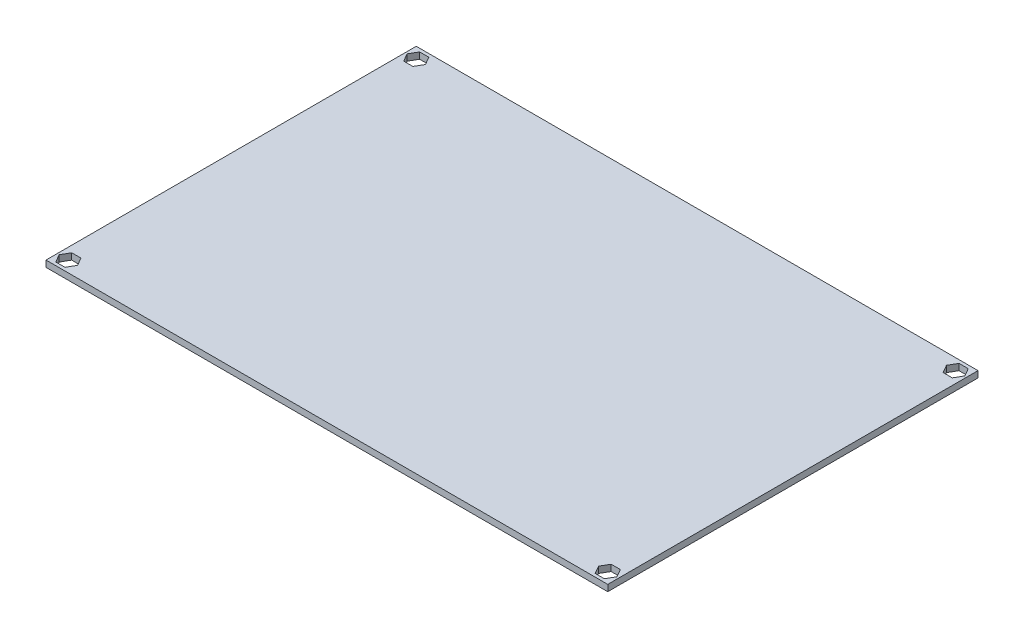
ISO-10303-21;
HEADER;
FILE_DESCRIPTION(('STEP AP214'),'2;1');
FILE_NAME('part.step','',(''),(''),'','','');
FILE_SCHEMA(('AUTOMOTIVE_DESIGN { 1 0 10303 214 1 1 1 1 }'));
ENDSEC;
DATA;
#1=APPLICATION_CONTEXT('core data for automotive mechanical design processes');
#2=APPLICATION_PROTOCOL_DEFINITION('international standard','automotive_design',2000,#1);
#3=PRODUCT_CONTEXT('',#1,'mechanical');
#4=PRODUCT('Part','Part','',(#3));
#5=PRODUCT_RELATED_PRODUCT_CATEGORY('part','',(#4));
#6=PRODUCT_DEFINITION_FORMATION('','',#4);
#7=PRODUCT_DEFINITION_CONTEXT('part definition',#1,'design');
#8=PRODUCT_DEFINITION('design','',#6,#7);
#9=PRODUCT_DEFINITION_SHAPE('','',#8);
#10=(LENGTH_UNIT() NAMED_UNIT(*) SI_UNIT(.MILLI.,.METRE.));
#11=(NAMED_UNIT(*) PLANE_ANGLE_UNIT() SI_UNIT($,.RADIAN.));
#12=(NAMED_UNIT(*) SI_UNIT($,.STERADIAN.) SOLID_ANGLE_UNIT());
#13=UNCERTAINTY_MEASURE_WITH_UNIT(LENGTH_MEASURE(1.E-05),#10,'distance_accuracy_value','');
#14=(GEOMETRIC_REPRESENTATION_CONTEXT(3) GLOBAL_UNCERTAINTY_ASSIGNED_CONTEXT((#13)) GLOBAL_UNIT_ASSIGNED_CONTEXT((#10,
#11,#12)) REPRESENTATION_CONTEXT('',''));
#15=CARTESIAN_POINT('',(0.,0.,0.));
#16=DIRECTION('',(0.,0.,1.));
#17=DIRECTION('',(1.,0.,0.));
#18=AXIS2_PLACEMENT_3D('',#15,#16,#17);
#19=CARTESIAN_POINT('',(-80.21928665786,2.,-70.1439894319683));
#20=DIRECTION('',(1.,0.,0.));
#21=DIRECTION('',(0.,0.,-1.));
#22=AXIS2_PLACEMENT_3D('',#19,#20,#21);
#23=PLANE('',#22);
#24=DIRECTION('',(0.,0.,1.));
#25=VECTOR('',#24,1.);
#26=CARTESIAN_POINT('',(-80.21928665786,0.,-70.1439894319683));
#27=LINE('',#26,#25);
#28=CARTESIAN_POINT('',(-80.21928665786,0.,-70.1439894319683));
#29=VERTEX_POINT('',#28);
#30=CARTESIAN_POINT('',(-80.21928665786,0.,45.8560105680317));
#31=VERTEX_POINT('',#30);
#32=EDGE_CURVE('E410',#29,#31,#27,.T.);
#33=ORIENTED_EDGE('',*,*,#32,.T.);
#34=DIRECTION('',(0.,-1.,0.));
#35=VECTOR('',#34,1.);
#36=CARTESIAN_POINT('',(-80.21928665786,2.,45.8560105680317));
#37=LINE('',#36,#35);
#38=CARTESIAN_POINT('',(-80.21928665786,2.,45.8560105680317));
#39=VERTEX_POINT('',#38);
#40=EDGE_CURVE('E11',#39,#31,#37,.T.);
#41=ORIENTED_EDGE('',*,*,#40,.F.);
#42=DIRECTION('',(0.,0.,1.));
#43=VECTOR('',#42,1.);
#44=CARTESIAN_POINT('',(-80.21928665786,2.,-70.1439894319683));
#45=LINE('',#44,#43);
#46=CARTESIAN_POINT('',(-80.21928665786,2.,-70.1439894319683));
#47=VERTEX_POINT('',#46);
#48=EDGE_CURVE('E421',#47,#39,#45,.T.);
#49=ORIENTED_EDGE('',*,*,#48,.F.);
#50=DIRECTION('',(0.,-1.,0.));
#51=VECTOR('',#50,1.);
#52=CARTESIAN_POINT('',(-80.21928665786,2.,-70.1439894319683));
#53=LINE('',#52,#51);
#54=EDGE_CURVE('E431',#47,#29,#53,.T.);
#55=ORIENTED_EDGE('',*,*,#54,.T.);
#56=EDGE_LOOP('',(#33,#41,#49,#55));
#57=FACE_BOUND('',#56,.T.);
#58=ADVANCED_FACE('F37',(#57),#23,.F.);
#59=CARTESIAN_POINT('',(-80.21928665786,2.,45.8560105680317));
#60=DIRECTION('',(0.,0.,-1.));
#61=DIRECTION('',(-1.,0.,0.));
#62=AXIS2_PLACEMENT_3D('',#59,#60,#61);
#63=PLANE('',#62);
#64=DIRECTION('',(1.,0.,0.));
#65=VECTOR('',#64,1.);
#66=CARTESIAN_POINT('',(-80.21928665786,0.,45.8560105680317));
#67=LINE('',#66,#65);
#68=CARTESIAN_POINT('',(95.7807133421401,0.,45.8560105680317));
#69=VERTEX_POINT('',#68);
#70=EDGE_CURVE('E434',#31,#69,#67,.T.);
#71=ORIENTED_EDGE('',*,*,#70,.T.);
#72=DIRECTION('',(0.,-1.,0.));
#73=VECTOR('',#72,1.);
#74=CARTESIAN_POINT('',(95.7807133421401,2.,45.8560105680317));
#75=LINE('',#74,#73);
#76=CARTESIAN_POINT('',(95.7807133421401,2.,45.8560105680317));
#77=VERTEX_POINT('',#76);
#78=EDGE_CURVE('E44',#77,#69,#75,.T.);
#79=ORIENTED_EDGE('',*,*,#78,.F.);
#80=DIRECTION('',(1.,0.,0.));
#81=VECTOR('',#80,1.);
#82=CARTESIAN_POINT('',(-80.21928665786,2.,45.8560105680317));
#83=LINE('',#82,#81);
#84=EDGE_CURVE('E424',#39,#77,#83,.T.);
#85=ORIENTED_EDGE('',*,*,#84,.F.);
#86=ORIENTED_EDGE('',*,*,#40,.T.);
#87=EDGE_LOOP('',(#71,#79,#85,#86));
#88=FACE_BOUND('',#87,.T.);
#89=ADVANCED_FACE('F463',(#88),#63,.F.);
#90=CARTESIAN_POINT('',(95.78071334214,2.,-70.1439894319683));
#91=DIRECTION('',(-1.,0.,0.));
#92=DIRECTION('',(0.,0.,1.));
#93=AXIS2_PLACEMENT_3D('',#90,#91,#92);
#94=PLANE('',#93);
#95=DIRECTION('',(0.,0.,-1.));
#96=VECTOR('',#95,1.);
#97=CARTESIAN_POINT('',(95.78071334214,0.,-70.1439894319683));
#98=LINE('',#97,#96);
#99=CARTESIAN_POINT('',(95.78071334214,0.,-70.1439894319683));
#100=VERTEX_POINT('',#99);
#101=EDGE_CURVE('E436',#69,#100,#98,.T.);
#102=ORIENTED_EDGE('',*,*,#101,.T.);
#103=DIRECTION('',(0.,-1.,0.));
#104=VECTOR('',#103,1.);
#105=CARTESIAN_POINT('',(95.78071334214,2.,-70.1439894319683));
#106=LINE('',#105,#104);
#107=CARTESIAN_POINT('',(95.78071334214,2.,-70.1439894319683));
#108=VERTEX_POINT('',#107);
#109=EDGE_CURVE('E441',#108,#100,#106,.T.);
#110=ORIENTED_EDGE('',*,*,#109,.F.);
#111=DIRECTION('',(0.,0.,-1.));
#112=VECTOR('',#111,1.);
#113=CARTESIAN_POINT('',(95.78071334214,2.,-70.1439894319683));
#114=LINE('',#113,#112);
#115=EDGE_CURVE('E427',#77,#108,#114,.T.);
#116=ORIENTED_EDGE('',*,*,#115,.F.);
#117=ORIENTED_EDGE('',*,*,#78,.T.);
#118=EDGE_LOOP('',(#102,#110,#116,#117));
#119=FACE_BOUND('',#118,.T.);
#120=ADVANCED_FACE('F448',(#119),#94,.F.);
#121=CARTESIAN_POINT('',(-80.21928665786,2.,-70.1439894319683));
#122=DIRECTION('',(0.,0.,1.));
#123=DIRECTION('',(1.,0.,0.));
#124=AXIS2_PLACEMENT_3D('',#121,#122,#123);
#125=PLANE('',#124);
#126=DIRECTION('',(-1.,0.,0.));
#127=VECTOR('',#126,1.);
#128=CARTESIAN_POINT('',(-80.21928665786,0.,-70.1439894319683));
#129=LINE('',#128,#127);
#130=EDGE_CURVE('E425',#100,#29,#129,.T.);
#131=ORIENTED_EDGE('',*,*,#130,.T.);
#132=ORIENTED_EDGE('',*,*,#54,.F.);
#133=DIRECTION('',(-1.,0.,0.));
#134=VECTOR('',#133,1.);
#135=CARTESIAN_POINT('',(-80.21928665786,2.,-70.1439894319683));
#136=LINE('',#135,#134);
#137=EDGE_CURVE('E429',#108,#47,#136,.T.);
#138=ORIENTED_EDGE('',*,*,#137,.F.);
#139=ORIENTED_EDGE('',*,*,#109,.T.);
#140=EDGE_LOOP('',(#131,#132,#138,#139));
#141=FACE_BOUND('',#140,.T.);
#142=ADVANCED_FACE('F456',(#141),#125,.F.);
#143=CARTESIAN_POINT('',(0.,2.,0.));
#144=DIRECTION('',(0.,1.,0.));
#145=DIRECTION('',(0.,0.,1.));
#146=AXIS2_PLACEMENT_3D('',#143,#144,#145);
#147=PLANE('',#146);
#148=DIRECTION('',(-0.499999999999999,0.,0.866025403784439));
#149=VECTOR('',#148,1.);
#150=CARTESIAN_POINT('',(-79.6060380038081,2.,42.3560105680318));
#151=LINE('',#150,#149);
#152=CARTESIAN_POINT('',(-78.162662330834,2.,39.8560105680318));
#153=VERTEX_POINT('',#152);
#154=CARTESIAN_POINT('',(-79.606038003808,2.,42.3560105680318));
#155=VERTEX_POINT('',#154);
#156=EDGE_CURVE('E51',#153,#155,#151,.T.);
#157=ORIENTED_EDGE('',*,*,#156,.F.);
#158=DIRECTION('',(-1.,0.,0.));
#159=VECTOR('',#158,1.);
#160=CARTESIAN_POINT('',(-78.162662330834,2.,39.8560105680318));
#161=LINE('',#160,#159);
#162=CARTESIAN_POINT('',(-75.2759109848859,2.,39.8560105680318));
#163=VERTEX_POINT('',#162);
#164=EDGE_CURVE('E332',#163,#153,#161,.T.);
#165=ORIENTED_EDGE('',*,*,#164,.F.);
#166=DIRECTION('',(-0.5,0.,-0.866025403784439));
#167=VECTOR('',#166,1.);
#168=CARTESIAN_POINT('',(-75.2759109848859,2.,39.8560105680318));
#169=LINE('',#168,#167);
#170=CARTESIAN_POINT('',(-73.8325353119118,2.,42.3560105680318));
#171=VERTEX_POINT('',#170);
#172=EDGE_CURVE('E358',#171,#163,#169,.T.);
#173=ORIENTED_EDGE('',*,*,#172,.F.);
#174=DIRECTION('',(0.500000000000001,0.,-0.866025403784438));
#175=VECTOR('',#174,1.);
#176=CARTESIAN_POINT('',(-73.8325353119118,2.,42.3560105680318));
#177=LINE('',#176,#175);
#178=CARTESIAN_POINT('',(-75.2759109848858,2.,44.8560105680318));
#179=VERTEX_POINT('',#178);
#180=EDGE_CURVE('E355',#179,#171,#177,.T.);
#181=ORIENTED_EDGE('',*,*,#180,.F.);
#182=DIRECTION('',(1.,0.,0.));
#183=VECTOR('',#182,1.);
#184=CARTESIAN_POINT('',(-75.2759109848858,2.,44.8560105680318));
#185=LINE('',#184,#183);
#186=CARTESIAN_POINT('',(-78.162662330834,2.,44.8560105680318));
#187=VERTEX_POINT('',#186);
#188=EDGE_CURVE('E352',#187,#179,#185,.T.);
#189=ORIENTED_EDGE('',*,*,#188,.F.);
#190=DIRECTION('',(0.499999999999997,0.,0.86602540378444));
#191=VECTOR('',#190,1.);
#192=CARTESIAN_POINT('',(-78.162662330834,2.,44.8560105680318));
#193=LINE('',#192,#191);
#194=EDGE_CURVE('E349',#155,#187,#193,.T.);
#195=ORIENTED_EDGE('',*,*,#194,.F.);
#196=EDGE_LOOP('',(#157,#165,#173,#181,#189,#195));
#197=FACE_BOUND('',#196,.T.);
#198=DIRECTION('',(-1.,0.,0.));
#199=VECTOR('',#198,1.);
#200=CARTESIAN_POINT('',(93.7240890151141,2.,39.8560105680317));
#201=LINE('',#200,#199);
#202=CARTESIAN_POINT('',(93.7240890151141,2.,39.8560105680317));
#203=VERTEX_POINT('',#202);
#204=CARTESIAN_POINT('',(90.8373376691659,2.,39.8560105680317));
#205=VERTEX_POINT('',#204);
#206=EDGE_CURVE('E59',#203,#205,#201,.T.);
#207=ORIENTED_EDGE('',*,*,#206,.F.);
#208=DIRECTION('',(-0.499999999999999,0.,-0.866025403784439));
#209=VECTOR('',#208,1.);
#210=CARTESIAN_POINT('',(95.1674646880881,2.,42.3560105680317));
#211=LINE('',#210,#209);
#212=CARTESIAN_POINT('',(95.1674646880881,2.,42.3560105680317));
#213=VERTEX_POINT('',#212);
#214=EDGE_CURVE('E286',#213,#203,#211,.T.);
#215=ORIENTED_EDGE('',*,*,#214,.F.);
#216=DIRECTION('',(0.499999999999997,0.,-0.86602540378444));
#217=VECTOR('',#216,1.);
#218=CARTESIAN_POINT('',(93.7240890151141,2.,44.8560105680318));
#219=LINE('',#218,#217);
#220=CARTESIAN_POINT('',(93.7240890151141,2.,44.8560105680318));
#221=VERTEX_POINT('',#220);
#222=EDGE_CURVE('E313',#221,#213,#219,.T.);
#223=ORIENTED_EDGE('',*,*,#222,.F.);
#224=DIRECTION('',(1.,0.,0.));
#225=VECTOR('',#224,1.);
#226=CARTESIAN_POINT('',(90.8373376691659,2.,44.8560105680318));
#227=LINE('',#226,#225);
#228=CARTESIAN_POINT('',(90.8373376691659,2.,44.8560105680318));
#229=VERTEX_POINT('',#228);
#230=EDGE_CURVE('E310',#229,#221,#227,.T.);
#231=ORIENTED_EDGE('',*,*,#230,.F.);
#232=DIRECTION('',(0.500000000000001,0.,0.866025403784438));
#233=VECTOR('',#232,1.);
#234=CARTESIAN_POINT('',(89.3939619961919,2.,42.3560105680318));
#235=LINE('',#234,#233);
#236=CARTESIAN_POINT('',(89.3939619961919,2.,42.3560105680318));
#237=VERTEX_POINT('',#236);
#238=EDGE_CURVE('E307',#237,#229,#235,.T.);
#239=ORIENTED_EDGE('',*,*,#238,.F.);
#240=DIRECTION('',(-0.5,0.,0.866025403784439));
#241=VECTOR('',#240,1.);
#242=CARTESIAN_POINT('',(90.837337669166,2.,39.8560105680317));
#243=LINE('',#242,#241);
#244=EDGE_CURVE('E303',#205,#237,#243,.T.);
#245=ORIENTED_EDGE('',*,*,#244,.F.);
#246=EDGE_LOOP('',(#207,#215,#223,#231,#239,#245));
#247=FACE_BOUND('',#246,.T.);
#248=DIRECTION('',(0.499999999999999,0.,-0.866025403784439));
#249=VECTOR('',#248,1.);
#250=CARTESIAN_POINT('',(95.1674646880881,2.,-66.6439894319683));
#251=LINE('',#250,#249);
#252=CARTESIAN_POINT('',(93.7240890151141,2.,-64.1439894319683));
#253=VERTEX_POINT('',#252);
#254=CARTESIAN_POINT('',(95.1674646880881,2.,-66.6439894319683));
#255=VERTEX_POINT('',#254);
#256=EDGE_CURVE('E228',#253,#255,#251,.T.);
#257=ORIENTED_EDGE('',*,*,#256,.F.);
#258=DIRECTION('',(1.,0.,0.));
#259=VECTOR('',#258,1.);
#260=CARTESIAN_POINT('',(93.7240890151141,2.,-64.1439894319683));
#261=LINE('',#260,#259);
#262=CARTESIAN_POINT('',(90.837337669166,2.,-64.1439894319683));
#263=VERTEX_POINT('',#262);
#264=EDGE_CURVE('E247',#263,#253,#261,.T.);
#265=ORIENTED_EDGE('',*,*,#264,.F.);
#266=DIRECTION('',(0.5,0.,0.866025403784439));
#267=VECTOR('',#266,1.);
#268=CARTESIAN_POINT('',(90.837337669166,2.,-64.1439894319683));
#269=LINE('',#268,#267);
#270=CARTESIAN_POINT('',(89.3939619961919,2.,-66.6439894319683));
#271=VERTEX_POINT('',#270);
#272=EDGE_CURVE('E250',#271,#263,#269,.T.);
#273=ORIENTED_EDGE('',*,*,#272,.F.);
#274=DIRECTION('',(-0.500000000000001,0.,0.866025403784438));
#275=VECTOR('',#274,1.);
#276=CARTESIAN_POINT('',(89.3939619961919,2.,-66.6439894319683));
#277=LINE('',#276,#275);
#278=CARTESIAN_POINT('',(90.8373376691659,2.,-69.1439894319683));
#279=VERTEX_POINT('',#278);
#280=EDGE_CURVE('E267',#279,#271,#277,.T.);
#281=ORIENTED_EDGE('',*,*,#280,.F.);
#282=DIRECTION('',(-1.,0.,0.));
#283=VECTOR('',#282,1.);
#284=CARTESIAN_POINT('',(90.8373376691659,2.,-69.1439894319683));
#285=LINE('',#284,#283);
#286=CARTESIAN_POINT('',(93.7240890151141,2.,-69.1439894319683));
#287=VERTEX_POINT('',#286);
#288=EDGE_CURVE('E264',#287,#279,#285,.T.);
#289=ORIENTED_EDGE('',*,*,#288,.F.);
#290=DIRECTION('',(-0.499999999999997,0.,-0.86602540378444));
#291=VECTOR('',#290,1.);
#292=CARTESIAN_POINT('',(93.7240890151141,2.,-69.1439894319683));
#293=LINE('',#292,#291);
#294=EDGE_CURVE('E261',#255,#287,#293,.T.);
#295=ORIENTED_EDGE('',*,*,#294,.F.);
#296=EDGE_LOOP('',(#257,#265,#273,#281,#289,#295));
#297=FACE_BOUND('',#296,.T.);
#298=DIRECTION('',(1.,0.,0.));
#299=VECTOR('',#298,1.);
#300=CARTESIAN_POINT('',(-78.162662330834,2.,-64.1439894319683));
#301=LINE('',#300,#299);
#302=CARTESIAN_POINT('',(-78.162662330834,2.,-64.1439894319683));
#303=VERTEX_POINT('',#302);
#304=CARTESIAN_POINT('',(-75.2759109848859,2.,-64.1439894319683));
#305=VERTEX_POINT('',#304);
#306=EDGE_CURVE('E274',#303,#305,#301,.T.);
#307=ORIENTED_EDGE('',*,*,#306,.F.);
#308=DIRECTION('',(0.499999999999997,0.,0.86602540378444));
#309=VECTOR('',#308,1.);
#310=CARTESIAN_POINT('',(-79.6060380038081,2.,-66.6439894319683));
#311=LINE('',#310,#309);
#312=CARTESIAN_POINT('',(-79.6060380038081,2.,-66.6439894319683));
#313=VERTEX_POINT('',#312);
#314=EDGE_CURVE('E377',#313,#303,#311,.T.);
#315=ORIENTED_EDGE('',*,*,#314,.F.);
#316=DIRECTION('',(-0.499999999999997,0.,0.86602540378444));
#317=VECTOR('',#316,1.);
#318=CARTESIAN_POINT('',(-78.162662330834,2.,-69.1439894319683));
#319=LINE('',#318,#317);
#320=CARTESIAN_POINT('',(-78.162662330834,2.,-69.1439894319683));
#321=VERTEX_POINT('',#320);
#322=EDGE_CURVE('E403',#321,#313,#319,.T.);
#323=ORIENTED_EDGE('',*,*,#322,.F.);
#324=DIRECTION('',(-1.,0.,0.));
#325=VECTOR('',#324,1.);
#326=CARTESIAN_POINT('',(-75.2759109848859,2.,-69.1439894319683));
#327=LINE('',#326,#325);
#328=CARTESIAN_POINT('',(-75.2759109848859,2.,-69.1439894319683));
#329=VERTEX_POINT('',#328);
#330=EDGE_CURVE('E400',#329,#321,#327,.T.);
#331=ORIENTED_EDGE('',*,*,#330,.F.);
#332=DIRECTION('',(-0.500000000000001,0.,-0.866025403784438));
#333=VECTOR('',#332,1.);
#334=CARTESIAN_POINT('',(-73.8325353119118,2.,-66.6439894319683));
#335=LINE('',#334,#333);
#336=CARTESIAN_POINT('',(-73.8325353119118,2.,-66.6439894319683));
#337=VERTEX_POINT('',#336);
#338=EDGE_CURVE('E397',#337,#329,#335,.T.);
#339=ORIENTED_EDGE('',*,*,#338,.F.);
#340=DIRECTION('',(0.5,0.,-0.866025403784439));
#341=VECTOR('',#340,1.);
#342=CARTESIAN_POINT('',(-75.2759109848859,2.,-64.1439894319683));
#343=LINE('',#342,#341);
#344=EDGE_CURVE('E394',#305,#337,#343,.T.);
#345=ORIENTED_EDGE('',*,*,#344,.F.);
#346=EDGE_LOOP('',(#307,#315,#323,#331,#339,#345));
#347=FACE_BOUND('',#346,.T.);
#348=ORIENTED_EDGE('',*,*,#48,.T.);
#349=ORIENTED_EDGE('',*,*,#84,.T.);
#350=ORIENTED_EDGE('',*,*,#115,.T.);
#351=ORIENTED_EDGE('',*,*,#137,.T.);
#352=EDGE_LOOP('',(#348,#349,#350,#351));
#353=FACE_BOUND('',#352,.T.);
#354=ADVANCED_FACE('F462',(#197,#247,#297,#347,#353),#147,.T.);
#355=CARTESIAN_POINT('',(0.,0.,0.));
#356=DIRECTION('',(0.,1.,0.));
#357=DIRECTION('',(0.,0.,1.));
#358=AXIS2_PLACEMENT_3D('',#355,#356,#357);
#359=PLANE('',#358);
#360=DIRECTION('',(-1.,0.,0.));
#361=VECTOR('',#360,1.);
#362=CARTESIAN_POINT('',(-78.162662330834,0.,39.8560105680318));
#363=LINE('',#362,#361);
#364=CARTESIAN_POINT('',(-75.2759109848859,0.,39.8560105680318));
#365=VERTEX_POINT('',#364);
#366=CARTESIAN_POINT('',(-78.162662330834,0.,39.8560105680318));
#367=VERTEX_POINT('',#366);
#368=EDGE_CURVE('E344',#365,#367,#363,.T.);
#369=ORIENTED_EDGE('',*,*,#368,.T.);
#370=DIRECTION('',(-0.499999999999999,0.,0.866025403784439));
#371=VECTOR('',#370,1.);
#372=CARTESIAN_POINT('',(-79.6060380038081,0.,42.3560105680318));
#373=LINE('',#372,#371);
#374=CARTESIAN_POINT('',(-79.6060380038081,0.,42.3560105680318));
#375=VERTEX_POINT('',#374);
#376=EDGE_CURVE('E328',#367,#375,#373,.T.);
#377=ORIENTED_EDGE('',*,*,#376,.T.);
#378=DIRECTION('',(0.499999999999997,0.,0.86602540378444));
#379=VECTOR('',#378,1.);
#380=CARTESIAN_POINT('',(-78.162662330834,0.,44.8560105680318));
#381=LINE('',#380,#379);
#382=CARTESIAN_POINT('',(-78.162662330834,0.,44.8560105680318));
#383=VERTEX_POINT('',#382);
#384=EDGE_CURVE('E331',#375,#383,#381,.T.);
#385=ORIENTED_EDGE('',*,*,#384,.T.);
#386=DIRECTION('',(1.,0.,0.));
#387=VECTOR('',#386,1.);
#388=CARTESIAN_POINT('',(-75.2759109848858,0.,44.8560105680318));
#389=LINE('',#388,#387);
#390=CARTESIAN_POINT('',(-75.2759109848858,0.,44.8560105680318));
#391=VERTEX_POINT('',#390);
#392=EDGE_CURVE('E335',#383,#391,#389,.T.);
#393=ORIENTED_EDGE('',*,*,#392,.T.);
#394=DIRECTION('',(0.500000000000001,0.,-0.866025403784438));
#395=VECTOR('',#394,1.);
#396=CARTESIAN_POINT('',(-73.8325353119118,0.,42.3560105680318));
#397=LINE('',#396,#395);
#398=CARTESIAN_POINT('',(-73.8325353119118,0.,42.3560105680318));
#399=VERTEX_POINT('',#398);
#400=EDGE_CURVE('E338',#391,#399,#397,.T.);
#401=ORIENTED_EDGE('',*,*,#400,.T.);
#402=DIRECTION('',(-0.5,0.,-0.866025403784439));
#403=VECTOR('',#402,1.);
#404=CARTESIAN_POINT('',(-75.2759109848859,0.,39.8560105680318));
#405=LINE('',#404,#403);
#406=EDGE_CURVE('E341',#399,#365,#405,.T.);
#407=ORIENTED_EDGE('',*,*,#406,.T.);
#408=EDGE_LOOP('',(#369,#377,#385,#393,#401,#407));
#409=FACE_BOUND('',#408,.T.);
#410=DIRECTION('',(-0.499999999999999,0.,-0.866025403784439));
#411=VECTOR('',#410,1.);
#412=CARTESIAN_POINT('',(95.1674646880881,0.,42.3560105680317));
#413=LINE('',#412,#411);
#414=CARTESIAN_POINT('',(95.1674646880881,0.,42.3560105680317));
#415=VERTEX_POINT('',#414);
#416=CARTESIAN_POINT('',(93.7240890151141,0.,39.8560105680317));
#417=VERTEX_POINT('',#416);
#418=EDGE_CURVE('E298',#415,#417,#413,.T.);
#419=ORIENTED_EDGE('',*,*,#418,.T.);
#420=DIRECTION('',(-1.,0.,0.));
#421=VECTOR('',#420,1.);
#422=CARTESIAN_POINT('',(93.7240890151141,0.,39.8560105680317));
#423=LINE('',#422,#421);
#424=CARTESIAN_POINT('',(90.837337669166,0.,39.8560105680317));
#425=VERTEX_POINT('',#424);
#426=EDGE_CURVE('E282',#417,#425,#423,.T.);
#427=ORIENTED_EDGE('',*,*,#426,.T.);
#428=DIRECTION('',(-0.5,0.,0.866025403784439));
#429=VECTOR('',#428,1.);
#430=CARTESIAN_POINT('',(90.837337669166,0.,39.8560105680317));
#431=LINE('',#430,#429);
#432=CARTESIAN_POINT('',(89.3939619961918,0.,42.3560105680318));
#433=VERTEX_POINT('',#432);
#434=EDGE_CURVE('E285',#425,#433,#431,.T.);
#435=ORIENTED_EDGE('',*,*,#434,.T.);
#436=DIRECTION('',(0.500000000000001,0.,0.866025403784438));
#437=VECTOR('',#436,1.);
#438=CARTESIAN_POINT('',(89.3939619961919,0.,42.3560105680318));
#439=LINE('',#438,#437);
#440=CARTESIAN_POINT('',(90.8373376691659,0.,44.8560105680318));
#441=VERTEX_POINT('',#440);
#442=EDGE_CURVE('E289',#433,#441,#439,.T.);
#443=ORIENTED_EDGE('',*,*,#442,.T.);
#444=DIRECTION('',(1.,0.,0.));
#445=VECTOR('',#444,1.);
#446=CARTESIAN_POINT('',(90.8373376691659,0.,44.8560105680318));
#447=LINE('',#446,#445);
#448=CARTESIAN_POINT('',(93.7240890151141,0.,44.8560105680318));
#449=VERTEX_POINT('',#448);
#450=EDGE_CURVE('E292',#441,#449,#447,.T.);
#451=ORIENTED_EDGE('',*,*,#450,.T.);
#452=DIRECTION('',(0.499999999999997,0.,-0.86602540378444));
#453=VECTOR('',#452,1.);
#454=CARTESIAN_POINT('',(93.7240890151141,0.,44.8560105680318));
#455=LINE('',#454,#453);
#456=EDGE_CURVE('E295',#449,#415,#455,.T.);
#457=ORIENTED_EDGE('',*,*,#456,.T.);
#458=EDGE_LOOP('',(#419,#427,#435,#443,#451,#457));
#459=FACE_BOUND('',#458,.T.);
#460=DIRECTION('',(1.,0.,0.));
#461=VECTOR('',#460,1.);
#462=CARTESIAN_POINT('',(93.7240890151141,0.,-64.1439894319683));
#463=LINE('',#462,#461);
#464=CARTESIAN_POINT('',(90.837337669166,0.,-64.1439894319683));
#465=VERTEX_POINT('',#464);
#466=CARTESIAN_POINT('',(93.7240890151141,0.,-64.1439894319683));
#467=VERTEX_POINT('',#466);
#468=EDGE_CURVE('E233',#465,#467,#463,.T.);
#469=ORIENTED_EDGE('',*,*,#468,.T.);
#470=DIRECTION('',(0.499999999999999,0.,-0.866025403784439));
#471=VECTOR('',#470,1.);
#472=CARTESIAN_POINT('',(95.1674646880881,0.,-66.6439894319683));
#473=LINE('',#472,#471);
#474=CARTESIAN_POINT('',(95.1674646880881,0.,-66.6439894319683));
#475=VERTEX_POINT('',#474);
#476=EDGE_CURVE('E225',#467,#475,#473,.T.);
#477=ORIENTED_EDGE('',*,*,#476,.T.);
#478=DIRECTION('',(-0.499999999999997,0.,-0.86602540378444));
#479=VECTOR('',#478,1.);
#480=CARTESIAN_POINT('',(93.7240890151141,0.,-69.1439894319683));
#481=LINE('',#480,#479);
#482=CARTESIAN_POINT('',(93.7240890151141,0.,-69.1439894319683));
#483=VERTEX_POINT('',#482);
#484=EDGE_CURVE('E237',#475,#483,#481,.T.);
#485=ORIENTED_EDGE('',*,*,#484,.T.);
#486=DIRECTION('',(-1.,0.,0.));
#487=VECTOR('',#486,1.);
#488=CARTESIAN_POINT('',(90.8373376691659,0.,-69.1439894319683));
#489=LINE('',#488,#487);
#490=CARTESIAN_POINT('',(90.8373376691659,0.,-69.1439894319683));
#491=VERTEX_POINT('',#490);
#492=EDGE_CURVE('E241',#483,#491,#489,.T.);
#493=ORIENTED_EDGE('',*,*,#492,.T.);
#494=DIRECTION('',(-0.500000000000001,0.,0.866025403784438));
#495=VECTOR('',#494,1.);
#496=CARTESIAN_POINT('',(89.3939619961919,0.,-66.6439894319683));
#497=LINE('',#496,#495);
#498=CARTESIAN_POINT('',(89.3939619961919,0.,-66.6439894319683));
#499=VERTEX_POINT('',#498);
#500=EDGE_CURVE('E254',#491,#499,#497,.T.);
#501=ORIENTED_EDGE('',*,*,#500,.T.);
#502=DIRECTION('',(0.5,0.,0.866025403784439));
#503=VECTOR('',#502,1.);
#504=CARTESIAN_POINT('',(90.837337669166,0.,-64.1439894319683));
#505=LINE('',#504,#503);
#506=EDGE_CURVE('E257',#499,#465,#505,.T.);
#507=ORIENTED_EDGE('',*,*,#506,.T.);
#508=EDGE_LOOP('',(#469,#477,#485,#493,#501,#507));
#509=FACE_BOUND('',#508,.T.);
#510=DIRECTION('',(0.499999999999997,0.,0.86602540378444));
#511=VECTOR('',#510,1.);
#512=CARTESIAN_POINT('',(-79.6060380038081,0.,-66.6439894319683));
#513=LINE('',#512,#511);
#514=CARTESIAN_POINT('',(-79.6060380038081,0.,-66.6439894319683));
#515=VERTEX_POINT('',#514);
#516=CARTESIAN_POINT('',(-78.162662330834,0.,-64.1439894319683));
#517=VERTEX_POINT('',#516);
#518=EDGE_CURVE('E389',#515,#517,#513,.T.);
#519=ORIENTED_EDGE('',*,*,#518,.T.);
#520=DIRECTION('',(1.,0.,0.));
#521=VECTOR('',#520,1.);
#522=CARTESIAN_POINT('',(-78.162662330834,0.,-64.1439894319683));
#523=LINE('',#522,#521);
#524=CARTESIAN_POINT('',(-75.2759109848859,0.,-64.1439894319683));
#525=VERTEX_POINT('',#524);
#526=EDGE_CURVE('E373',#517,#525,#523,.T.);
#527=ORIENTED_EDGE('',*,*,#526,.T.);
#528=DIRECTION('',(0.5,0.,-0.866025403784439));
#529=VECTOR('',#528,1.);
#530=CARTESIAN_POINT('',(-75.2759109848859,0.,-64.1439894319683));
#531=LINE('',#530,#529);
#532=CARTESIAN_POINT('',(-73.8325353119118,0.,-66.6439894319683));
#533=VERTEX_POINT('',#532);
#534=EDGE_CURVE('E376',#525,#533,#531,.T.);
#535=ORIENTED_EDGE('',*,*,#534,.T.);
#536=DIRECTION('',(-0.500000000000001,0.,-0.866025403784438));
#537=VECTOR('',#536,1.);
#538=CARTESIAN_POINT('',(-73.8325353119118,0.,-66.6439894319683));
#539=LINE('',#538,#537);
#540=CARTESIAN_POINT('',(-75.2759109848859,0.,-69.1439894319683));
#541=VERTEX_POINT('',#540);
#542=EDGE_CURVE('E380',#533,#541,#539,.T.);
#543=ORIENTED_EDGE('',*,*,#542,.T.);
#544=DIRECTION('',(-1.,0.,0.));
#545=VECTOR('',#544,1.);
#546=CARTESIAN_POINT('',(-75.2759109848859,0.,-69.1439894319683));
#547=LINE('',#546,#545);
#548=CARTESIAN_POINT('',(-78.162662330834,0.,-69.1439894319683));
#549=VERTEX_POINT('',#548);
#550=EDGE_CURVE('E383',#541,#549,#547,.T.);
#551=ORIENTED_EDGE('',*,*,#550,.T.);
#552=DIRECTION('',(-0.499999999999997,0.,0.86602540378444));
#553=VECTOR('',#552,1.);
#554=CARTESIAN_POINT('',(-78.162662330834,0.,-69.1439894319683));
#555=LINE('',#554,#553);
#556=EDGE_CURVE('E386',#549,#515,#555,.T.);
#557=ORIENTED_EDGE('',*,*,#556,.T.);
#558=EDGE_LOOP('',(#519,#527,#535,#543,#551,#557));
#559=FACE_BOUND('',#558,.T.);
#560=ORIENTED_EDGE('',*,*,#32,.F.);
#561=ORIENTED_EDGE('',*,*,#130,.F.);
#562=ORIENTED_EDGE('',*,*,#101,.F.);
#563=ORIENTED_EDGE('',*,*,#70,.F.);
#564=EDGE_LOOP('',(#560,#561,#562,#563));
#565=FACE_BOUND('',#564,.T.);
#566=ADVANCED_FACE('F243',(#409,#459,#509,#559,#565),#359,.F.);
#567=CARTESIAN_POINT('',(-78.162662330834,0.,-64.1439894319683));
#568=DIRECTION('',(0.,0.,1.));
#569=DIRECTION('',(1.,0.,0.));
#570=AXIS2_PLACEMENT_3D('',#567,#568,#569);
#571=PLANE('',#570);
#572=ORIENTED_EDGE('',*,*,#306,.T.);
#573=DIRECTION('',(0.,1.,0.));
#574=VECTOR('',#573,1.);
#575=CARTESIAN_POINT('',(-75.2759109848859,0.,-64.1439894319683));
#576=LINE('',#575,#574);
#577=EDGE_CURVE('E392',#525,#305,#576,.T.);
#578=ORIENTED_EDGE('',*,*,#577,.F.);
#579=ORIENTED_EDGE('',*,*,#526,.F.);
#580=DIRECTION('',(0.,1.,0.));
#581=VECTOR('',#580,1.);
#582=CARTESIAN_POINT('',(-78.162662330834,0.,-64.1439894319683));
#583=LINE('',#582,#581);
#584=EDGE_CURVE('E408',#517,#303,#583,.T.);
#585=ORIENTED_EDGE('',*,*,#584,.T.);
#586=EDGE_LOOP('',(#572,#578,#579,#585));
#587=FACE_BOUND('',#586,.T.);
#588=ADVANCED_FACE('F475',(#587),#571,.F.);
#589=CARTESIAN_POINT('',(-79.6060380038081,0.,-66.6439894319683));
#590=DIRECTION('',(-0.86602540378444,0.,0.499999999999997));
#591=DIRECTION('',(0.499999999999997,0.,0.86602540378444));
#592=AXIS2_PLACEMENT_3D('',#589,#590,#591);
#593=PLANE('',#592);
#594=ORIENTED_EDGE('',*,*,#314,.T.);
#595=ORIENTED_EDGE('',*,*,#584,.F.);
#596=ORIENTED_EDGE('',*,*,#518,.F.);
#597=DIRECTION('',(0.,1.,0.));
#598=VECTOR('',#597,1.);
#599=CARTESIAN_POINT('',(-79.6060380038081,0.,-66.6439894319683));
#600=LINE('',#599,#598);
#601=EDGE_CURVE('E411',#515,#313,#600,.T.);
#602=ORIENTED_EDGE('',*,*,#601,.T.);
#603=EDGE_LOOP('',(#594,#595,#596,#602));
#604=FACE_BOUND('',#603,.T.);
#605=ADVANCED_FACE('F482',(#604),#593,.F.);
#606=CARTESIAN_POINT('',(-78.162662330834,0.,-69.1439894319683));
#607=DIRECTION('',(-0.86602540378444,0.,-0.499999999999997));
#608=DIRECTION('',(-0.499999999999997,0.,0.86602540378444));
#609=AXIS2_PLACEMENT_3D('',#606,#607,#608);
#610=PLANE('',#609);
#611=ORIENTED_EDGE('',*,*,#322,.T.);
#612=ORIENTED_EDGE('',*,*,#601,.F.);
#613=ORIENTED_EDGE('',*,*,#556,.F.);
#614=DIRECTION('',(0.,1.,0.));
#615=VECTOR('',#614,1.);
#616=CARTESIAN_POINT('',(-78.162662330834,0.,-69.1439894319683));
#617=LINE('',#616,#615);
#618=EDGE_CURVE('E413',#549,#321,#617,.T.);
#619=ORIENTED_EDGE('',*,*,#618,.T.);
#620=EDGE_LOOP('',(#611,#612,#613,#619));
#621=FACE_BOUND('',#620,.T.);
#622=ADVANCED_FACE('F495',(#621),#610,.F.);
#623=CARTESIAN_POINT('',(-75.2759109848859,0.,-69.1439894319683));
#624=DIRECTION('',(0.,0.,-1.));
#625=DIRECTION('',(-1.,0.,0.));
#626=AXIS2_PLACEMENT_3D('',#623,#624,#625);
#627=PLANE('',#626);
#628=ORIENTED_EDGE('',*,*,#330,.T.);
#629=ORIENTED_EDGE('',*,*,#618,.F.);
#630=ORIENTED_EDGE('',*,*,#550,.F.);
#631=DIRECTION('',(0.,1.,0.));
#632=VECTOR('',#631,1.);
#633=CARTESIAN_POINT('',(-75.2759109848859,0.,-69.1439894319683));
#634=LINE('',#633,#632);
#635=EDGE_CURVE('E415',#541,#329,#634,.T.);
#636=ORIENTED_EDGE('',*,*,#635,.T.);
#637=EDGE_LOOP('',(#628,#629,#630,#636));
#638=FACE_BOUND('',#637,.T.);
#639=ADVANCED_FACE('F491',(#638),#627,.F.);
#640=CARTESIAN_POINT('',(-73.8325353119118,0.,-66.6439894319683));
#641=DIRECTION('',(0.866025403784438,0.,-0.500000000000001));
#642=DIRECTION('',(-0.500000000000001,0.,-0.866025403784438));
#643=AXIS2_PLACEMENT_3D('',#640,#641,#642);
#644=PLANE('',#643);
#645=ORIENTED_EDGE('',*,*,#338,.T.);
#646=ORIENTED_EDGE('',*,*,#635,.F.);
#647=ORIENTED_EDGE('',*,*,#542,.F.);
#648=DIRECTION('',(0.,1.,0.));
#649=VECTOR('',#648,1.);
#650=CARTESIAN_POINT('',(-73.8325353119118,0.,-66.6439894319683));
#651=LINE('',#650,#649);
#652=EDGE_CURVE('E417',#533,#337,#651,.T.);
#653=ORIENTED_EDGE('',*,*,#652,.T.);
#654=EDGE_LOOP('',(#645,#646,#647,#653));
#655=FACE_BOUND('',#654,.T.);
#656=ADVANCED_FACE('F487',(#655),#644,.F.);
#657=CARTESIAN_POINT('',(-75.2759109848859,0.,-64.1439894319683));
#658=DIRECTION('',(0.866025403784439,0.,0.5));
#659=DIRECTION('',(0.5,0.,-0.866025403784439));
#660=AXIS2_PLACEMENT_3D('',#657,#658,#659);
#661=PLANE('',#660);
#662=ORIENTED_EDGE('',*,*,#344,.T.);
#663=ORIENTED_EDGE('',*,*,#652,.F.);
#664=ORIENTED_EDGE('',*,*,#534,.F.);
#665=ORIENTED_EDGE('',*,*,#577,.T.);
#666=EDGE_LOOP('',(#662,#663,#664,#665));
#667=FACE_BOUND('',#666,.T.);
#668=ADVANCED_FACE('F484',(#667),#661,.F.);
#669=CARTESIAN_POINT('',(95.1674646880881,0.,-66.6439894319683));
#670=DIRECTION('',(0.866025403784439,0.,0.499999999999999));
#671=DIRECTION('',(0.499999999999999,0.,-0.866025403784439));
#672=AXIS2_PLACEMENT_3D('',#669,#670,#671);
#673=PLANE('',#672);
#674=ORIENTED_EDGE('',*,*,#256,.T.);
#675=DIRECTION('',(0.,1.,0.));
#676=VECTOR('',#675,1.);
#677=CARTESIAN_POINT('',(95.1674646880881,0.,-66.6439894319683));
#678=LINE('',#677,#676);
#679=EDGE_CURVE('E221',#475,#255,#678,.T.);
#680=ORIENTED_EDGE('',*,*,#679,.F.);
#681=ORIENTED_EDGE('',*,*,#476,.F.);
#682=DIRECTION('',(0.,1.,0.));
#683=VECTOR('',#682,1.);
#684=CARTESIAN_POINT('',(93.7240890151141,0.,-64.1439894319683));
#685=LINE('',#684,#683);
#686=EDGE_CURVE('E272',#467,#253,#685,.T.);
#687=ORIENTED_EDGE('',*,*,#686,.T.);
#688=EDGE_LOOP('',(#674,#680,#681,#687));
#689=FACE_BOUND('',#688,.T.);
#690=ADVANCED_FACE('F223',(#689),#673,.F.);
#691=CARTESIAN_POINT('',(93.7240890151141,0.,-64.1439894319683));
#692=DIRECTION('',(0.,0.,1.));
#693=DIRECTION('',(1.,0.,0.));
#694=AXIS2_PLACEMENT_3D('',#691,#692,#693);
#695=PLANE('',#694);
#696=ORIENTED_EDGE('',*,*,#264,.T.);
#697=ORIENTED_EDGE('',*,*,#686,.F.);
#698=ORIENTED_EDGE('',*,*,#468,.F.);
#699=DIRECTION('',(0.,1.,0.));
#700=VECTOR('',#699,1.);
#701=CARTESIAN_POINT('',(90.837337669166,0.,-64.1439894319683));
#702=LINE('',#701,#700);
#703=EDGE_CURVE('E275',#465,#263,#702,.T.);
#704=ORIENTED_EDGE('',*,*,#703,.T.);
#705=EDGE_LOOP('',(#696,#697,#698,#704));
#706=FACE_BOUND('',#705,.T.);
#707=ADVANCED_FACE('F551',(#706),#695,.F.);
#708=CARTESIAN_POINT('',(90.837337669166,0.,-64.1439894319683));
#709=DIRECTION('',(-0.866025403784439,0.,0.5));
#710=DIRECTION('',(0.5,0.,0.866025403784439));
#711=AXIS2_PLACEMENT_3D('',#708,#709,#710);
#712=PLANE('',#711);
#713=ORIENTED_EDGE('',*,*,#272,.T.);
#714=ORIENTED_EDGE('',*,*,#703,.F.);
#715=ORIENTED_EDGE('',*,*,#506,.F.);
#716=DIRECTION('',(0.,1.,0.));
#717=VECTOR('',#716,1.);
#718=CARTESIAN_POINT('',(89.3939619961919,0.,-66.6439894319683));
#719=LINE('',#718,#717);
#720=EDGE_CURVE('E277',#499,#271,#719,.T.);
#721=ORIENTED_EDGE('',*,*,#720,.T.);
#722=EDGE_LOOP('',(#713,#714,#715,#721));
#723=FACE_BOUND('',#722,.T.);
#724=ADVANCED_FACE('F561',(#723),#712,.F.);
#725=CARTESIAN_POINT('',(89.3939619961919,0.,-66.6439894319683));
#726=DIRECTION('',(-0.866025403784438,0.,-0.500000000000001));
#727=DIRECTION('',(-0.500000000000001,0.,0.866025403784438));
#728=AXIS2_PLACEMENT_3D('',#725,#726,#727);
#729=PLANE('',#728);
#730=ORIENTED_EDGE('',*,*,#280,.T.);
#731=ORIENTED_EDGE('',*,*,#720,.F.);
#732=ORIENTED_EDGE('',*,*,#500,.F.);
#733=DIRECTION('',(0.,1.,0.));
#734=VECTOR('',#733,1.);
#735=CARTESIAN_POINT('',(90.8373376691659,0.,-69.1439894319683));
#736=LINE('',#735,#734);
#737=EDGE_CURVE('E279',#491,#279,#736,.T.);
#738=ORIENTED_EDGE('',*,*,#737,.T.);
#739=EDGE_LOOP('',(#730,#731,#732,#738));
#740=FACE_BOUND('',#739,.T.);
#741=ADVANCED_FACE('F557',(#740),#729,.F.);
#742=CARTESIAN_POINT('',(90.8373376691659,0.,-69.1439894319683));
#743=DIRECTION('',(0.,0.,-1.));
#744=DIRECTION('',(-1.,0.,0.));
#745=AXIS2_PLACEMENT_3D('',#742,#743,#744);
#746=PLANE('',#745);
#747=ORIENTED_EDGE('',*,*,#288,.T.);
#748=ORIENTED_EDGE('',*,*,#737,.F.);
#749=ORIENTED_EDGE('',*,*,#492,.F.);
#750=DIRECTION('',(0.,1.,0.));
#751=VECTOR('',#750,1.);
#752=CARTESIAN_POINT('',(93.7240890151141,0.,-69.1439894319683));
#753=LINE('',#752,#751);
#754=EDGE_CURVE('E232',#483,#287,#753,.T.);
#755=ORIENTED_EDGE('',*,*,#754,.T.);
#756=EDGE_LOOP('',(#747,#748,#749,#755));
#757=FACE_BOUND('',#756,.T.);
#758=ADVANCED_FACE('F554',(#757),#746,.F.);
#759=CARTESIAN_POINT('',(93.7240890151141,0.,-69.1439894319683));
#760=DIRECTION('',(0.86602540378444,0.,-0.499999999999997));
#761=DIRECTION('',(-0.499999999999997,0.,-0.86602540378444));
#762=AXIS2_PLACEMENT_3D('',#759,#760,#761);
#763=PLANE('',#762);
#764=ORIENTED_EDGE('',*,*,#294,.T.);
#765=ORIENTED_EDGE('',*,*,#754,.F.);
#766=ORIENTED_EDGE('',*,*,#484,.F.);
#767=ORIENTED_EDGE('',*,*,#679,.T.);
#768=EDGE_LOOP('',(#764,#765,#766,#767));
#769=FACE_BOUND('',#768,.T.);
#770=ADVANCED_FACE('F238',(#769),#763,.F.);
#771=CARTESIAN_POINT('',(93.7240890151141,0.,39.8560105680317));
#772=DIRECTION('',(0.,0.,-1.));
#773=DIRECTION('',(-1.,0.,0.));
#774=AXIS2_PLACEMENT_3D('',#771,#772,#773);
#775=PLANE('',#774);
#776=ORIENTED_EDGE('',*,*,#206,.T.);
#777=DIRECTION('',(0.,1.,0.));
#778=VECTOR('',#777,1.);
#779=CARTESIAN_POINT('',(90.837337669166,0.,39.8560105680317));
#780=LINE('',#779,#778);
#781=EDGE_CURVE('E301',#425,#205,#780,.T.);
#782=ORIENTED_EDGE('',*,*,#781,.F.);
#783=ORIENTED_EDGE('',*,*,#426,.F.);
#784=DIRECTION('',(0.,1.,0.));
#785=VECTOR('',#784,1.);
#786=CARTESIAN_POINT('',(93.7240890151141,0.,39.8560105680317));
#787=LINE('',#786,#785);
#788=EDGE_CURVE('E262',#417,#203,#787,.T.);
#789=ORIENTED_EDGE('',*,*,#788,.T.);
#790=EDGE_LOOP('',(#776,#782,#783,#789));
#791=FACE_BOUND('',#790,.T.);
#792=ADVANCED_FACE('F527',(#791),#775,.F.);
#793=CARTESIAN_POINT('',(95.1674646880881,0.,42.3560105680317));
#794=DIRECTION('',(0.866025403784439,0.,-0.499999999999999));
#795=DIRECTION('',(-0.499999999999999,0.,-0.866025403784439));
#796=AXIS2_PLACEMENT_3D('',#793,#794,#795);
#797=PLANE('',#796);
#798=ORIENTED_EDGE('',*,*,#214,.T.);
#799=ORIENTED_EDGE('',*,*,#788,.F.);
#800=ORIENTED_EDGE('',*,*,#418,.F.);
#801=DIRECTION('',(0.,1.,0.));
#802=VECTOR('',#801,1.);
#803=CARTESIAN_POINT('',(95.1674646880881,0.,42.3560105680317));
#804=LINE('',#803,#802);
#805=EDGE_CURVE('E319',#415,#213,#804,.T.);
#806=ORIENTED_EDGE('',*,*,#805,.T.);
#807=EDGE_LOOP('',(#798,#799,#800,#806));
#808=FACE_BOUND('',#807,.T.);
#809=ADVANCED_FACE('F530',(#808),#797,.F.);
#810=CARTESIAN_POINT('',(93.7240890151141,0.,44.8560105680318));
#811=DIRECTION('',(0.86602540378444,0.,0.499999999999997));
#812=DIRECTION('',(0.499999999999997,0.,-0.86602540378444));
#813=AXIS2_PLACEMENT_3D('',#810,#811,#812);
#814=PLANE('',#813);
#815=ORIENTED_EDGE('',*,*,#222,.T.);
#816=ORIENTED_EDGE('',*,*,#805,.F.);
#817=ORIENTED_EDGE('',*,*,#456,.F.);
#818=DIRECTION('',(0.,1.,0.));
#819=VECTOR('',#818,1.);
#820=CARTESIAN_POINT('',(93.7240890151141,0.,44.8560105680318));
#821=LINE('',#820,#819);
#822=EDGE_CURVE('E321',#449,#221,#821,.T.);
#823=ORIENTED_EDGE('',*,*,#822,.T.);
#824=EDGE_LOOP('',(#815,#816,#817,#823));
#825=FACE_BOUND('',#824,.T.);
#826=ADVANCED_FACE('F541',(#825),#814,.F.);
#827=CARTESIAN_POINT('',(90.8373376691659,0.,44.8560105680318));
#828=DIRECTION('',(0.,0.,1.));
#829=DIRECTION('',(1.,0.,0.));
#830=AXIS2_PLACEMENT_3D('',#827,#828,#829);
#831=PLANE('',#830);
#832=ORIENTED_EDGE('',*,*,#230,.T.);
#833=ORIENTED_EDGE('',*,*,#822,.F.);
#834=ORIENTED_EDGE('',*,*,#450,.F.);
#835=DIRECTION('',(0.,1.,0.));
#836=VECTOR('',#835,1.);
#837=CARTESIAN_POINT('',(90.8373376691659,0.,44.8560105680318));
#838=LINE('',#837,#836);
#839=EDGE_CURVE('E323',#441,#229,#838,.T.);
#840=ORIENTED_EDGE('',*,*,#839,.T.);
#841=EDGE_LOOP('',(#832,#833,#834,#840));
#842=FACE_BOUND('',#841,.T.);
#843=ADVANCED_FACE('F537',(#842),#831,.F.);
#844=CARTESIAN_POINT('',(89.3939619961919,0.,42.3560105680318));
#845=DIRECTION('',(-0.866025403784438,0.,0.500000000000001));
#846=DIRECTION('',(0.500000000000001,0.,0.866025403784438));
#847=AXIS2_PLACEMENT_3D('',#844,#845,#846);
#848=PLANE('',#847);
#849=ORIENTED_EDGE('',*,*,#238,.T.);
#850=ORIENTED_EDGE('',*,*,#839,.F.);
#851=ORIENTED_EDGE('',*,*,#442,.F.);
#852=DIRECTION('',(0.,1.,0.));
#853=VECTOR('',#852,1.);
#854=CARTESIAN_POINT('',(89.3939619961919,0.,42.3560105680318));
#855=LINE('',#854,#853);
#856=EDGE_CURVE('E325',#433,#237,#855,.T.);
#857=ORIENTED_EDGE('',*,*,#856,.T.);
#858=EDGE_LOOP('',(#849,#850,#851,#857));
#859=FACE_BOUND('',#858,.T.);
#860=ADVANCED_FACE('F533',(#859),#848,.F.);
#861=CARTESIAN_POINT('',(90.837337669166,0.,39.8560105680317));
#862=DIRECTION('',(-0.866025403784439,0.,-0.5));
#863=DIRECTION('',(-0.5,0.,0.866025403784439));
#864=AXIS2_PLACEMENT_3D('',#861,#862,#863);
#865=PLANE('',#864);
#866=ORIENTED_EDGE('',*,*,#244,.T.);
#867=ORIENTED_EDGE('',*,*,#856,.F.);
#868=ORIENTED_EDGE('',*,*,#434,.F.);
#869=ORIENTED_EDGE('',*,*,#781,.T.);
#870=EDGE_LOOP('',(#866,#867,#868,#869));
#871=FACE_BOUND('',#870,.T.);
#872=ADVANCED_FACE('F507',(#871),#865,.F.);
#873=CARTESIAN_POINT('',(-79.6060380038081,0.,42.3560105680318));
#874=DIRECTION('',(-0.866025403784439,0.,-0.499999999999999));
#875=DIRECTION('',(-0.499999999999999,0.,0.866025403784439));
#876=AXIS2_PLACEMENT_3D('',#873,#874,#875);
#877=PLANE('',#876);
#878=ORIENTED_EDGE('',*,*,#156,.T.);
#879=DIRECTION('',(0.,1.,0.));
#880=VECTOR('',#879,1.);
#881=CARTESIAN_POINT('',(-79.6060380038081,0.,42.3560105680318));
#882=LINE('',#881,#880);
#883=EDGE_CURVE('E347',#375,#155,#882,.T.);
#884=ORIENTED_EDGE('',*,*,#883,.F.);
#885=ORIENTED_EDGE('',*,*,#376,.F.);
#886=DIRECTION('',(0.,1.,0.));
#887=VECTOR('',#886,1.);
#888=CARTESIAN_POINT('',(-78.162662330834,0.,39.8560105680318));
#889=LINE('',#888,#887);
#890=EDGE_CURVE('E304',#367,#153,#889,.T.);
#891=ORIENTED_EDGE('',*,*,#890,.T.);
#892=EDGE_LOOP('',(#878,#884,#885,#891));
#893=FACE_BOUND('',#892,.T.);
#894=ADVANCED_FACE('F503',(#893),#877,.F.);
#895=CARTESIAN_POINT('',(-78.162662330834,0.,39.8560105680318));
#896=DIRECTION('',(0.,0.,-1.));
#897=DIRECTION('',(-1.,0.,0.));
#898=AXIS2_PLACEMENT_3D('',#895,#896,#897);
#899=PLANE('',#898);
#900=ORIENTED_EDGE('',*,*,#164,.T.);
#901=ORIENTED_EDGE('',*,*,#890,.F.);
#902=ORIENTED_EDGE('',*,*,#368,.F.);
#903=DIRECTION('',(0.,1.,0.));
#904=VECTOR('',#903,1.);
#905=CARTESIAN_POINT('',(-75.2759109848859,0.,39.8560105680318));
#906=LINE('',#905,#904);
#907=EDGE_CURVE('E364',#365,#163,#906,.T.);
#908=ORIENTED_EDGE('',*,*,#907,.T.);
#909=EDGE_LOOP('',(#900,#901,#902,#908));
#910=FACE_BOUND('',#909,.T.);
#911=ADVANCED_FACE('F506',(#910),#899,.F.);
#912=CARTESIAN_POINT('',(-75.2759109848859,0.,39.8560105680318));
#913=DIRECTION('',(0.866025403784439,0.,-0.5));
#914=DIRECTION('',(-0.5,0.,-0.866025403784439));
#915=AXIS2_PLACEMENT_3D('',#912,#913,#914);
#916=PLANE('',#915);
#917=ORIENTED_EDGE('',*,*,#172,.T.);
#918=ORIENTED_EDGE('',*,*,#907,.F.);
#919=ORIENTED_EDGE('',*,*,#406,.F.);
#920=DIRECTION('',(0.,1.,0.));
#921=VECTOR('',#920,1.);
#922=CARTESIAN_POINT('',(-73.8325353119118,0.,42.3560105680318));
#923=LINE('',#922,#921);
#924=EDGE_CURVE('E366',#399,#171,#923,.T.);
#925=ORIENTED_EDGE('',*,*,#924,.T.);
#926=EDGE_LOOP('',(#917,#918,#919,#925));
#927=FACE_BOUND('',#926,.T.);
#928=ADVANCED_FACE('F519',(#927),#916,.F.);
#929=CARTESIAN_POINT('',(-73.8325353119118,0.,42.3560105680318));
#930=DIRECTION('',(0.866025403784438,0.,0.500000000000001));
#931=DIRECTION('',(0.500000000000001,0.,-0.866025403784438));
#932=AXIS2_PLACEMENT_3D('',#929,#930,#931);
#933=PLANE('',#932);
#934=ORIENTED_EDGE('',*,*,#180,.T.);
#935=ORIENTED_EDGE('',*,*,#924,.F.);
#936=ORIENTED_EDGE('',*,*,#400,.F.);
#937=DIRECTION('',(0.,1.,0.));
#938=VECTOR('',#937,1.);
#939=CARTESIAN_POINT('',(-75.2759109848858,0.,44.8560105680318));
#940=LINE('',#939,#938);
#941=EDGE_CURVE('E368',#391,#179,#940,.T.);
#942=ORIENTED_EDGE('',*,*,#941,.T.);
#943=EDGE_LOOP('',(#934,#935,#936,#942));
#944=FACE_BOUND('',#943,.T.);
#945=ADVANCED_FACE('F515',(#944),#933,.F.);
#946=CARTESIAN_POINT('',(-75.2759109848858,0.,44.8560105680318));
#947=DIRECTION('',(0.,0.,1.));
#948=DIRECTION('',(1.,0.,0.));
#949=AXIS2_PLACEMENT_3D('',#946,#947,#948);
#950=PLANE('',#949);
#951=ORIENTED_EDGE('',*,*,#188,.T.);
#952=ORIENTED_EDGE('',*,*,#941,.F.);
#953=ORIENTED_EDGE('',*,*,#392,.F.);
#954=DIRECTION('',(0.,1.,0.));
#955=VECTOR('',#954,1.);
#956=CARTESIAN_POINT('',(-78.162662330834,0.,44.8560105680318));
#957=LINE('',#956,#955);
#958=EDGE_CURVE('E370',#383,#187,#957,.T.);
#959=ORIENTED_EDGE('',*,*,#958,.T.);
#960=EDGE_LOOP('',(#951,#952,#953,#959));
#961=FACE_BOUND('',#960,.T.);
#962=ADVANCED_FACE('F511',(#961),#950,.F.);
#963=CARTESIAN_POINT('',(-78.162662330834,0.,44.8560105680318));
#964=DIRECTION('',(-0.86602540378444,0.,0.499999999999997));
#965=DIRECTION('',(0.499999999999997,0.,0.86602540378444));
#966=AXIS2_PLACEMENT_3D('',#963,#964,#965);
#967=PLANE('',#966);
#968=ORIENTED_EDGE('',*,*,#194,.T.);
#969=ORIENTED_EDGE('',*,*,#958,.F.);
#970=ORIENTED_EDGE('',*,*,#384,.F.);
#971=ORIENTED_EDGE('',*,*,#883,.T.);
#972=EDGE_LOOP('',(#968,#969,#970,#971));
#973=FACE_BOUND('',#972,.T.);
#974=ADVANCED_FACE('F508',(#973),#967,.F.);
#975=CLOSED_SHELL('',(#58,#89,#120,#142,#354,#566,#588,#605,#622,#639,#656,#668,#690,#707,#724,
#741,#758,#770,#792,#809,#826,#843,#860,#872,#894,#911,#928,#945,#962,#974));
#976=MANIFOLD_SOLID_BREP('B2',#975);
#977=ADVANCED_BREP_SHAPE_REPRESENTATION('',(#18,#976),#14);
#978=SHAPE_DEFINITION_REPRESENTATION(#9,#977);
ENDSEC;
END-ISO-10303-21;
